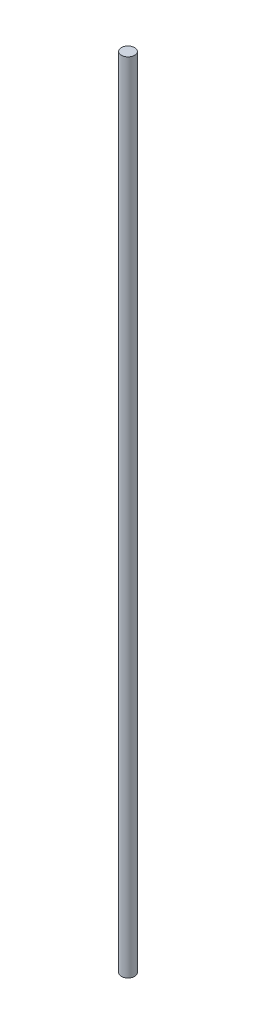
ISO-10303-21;
HEADER;
FILE_DESCRIPTION(('STEP AP214'),'2;1');
FILE_NAME('part.step','',(''),(''),'','','');
FILE_SCHEMA(('AUTOMOTIVE_DESIGN { 1 0 10303 214 1 1 1 1 }'));
ENDSEC;
DATA;
#1=APPLICATION_CONTEXT('core data for automotive mechanical design processes');
#2=APPLICATION_PROTOCOL_DEFINITION('international standard','automotive_design',2000,#1);
#3=PRODUCT_CONTEXT('',#1,'mechanical');
#4=PRODUCT('Part','Part','',(#3));
#5=PRODUCT_RELATED_PRODUCT_CATEGORY('part','',(#4));
#6=PRODUCT_DEFINITION_FORMATION('','',#4);
#7=PRODUCT_DEFINITION_CONTEXT('part definition',#1,'design');
#8=PRODUCT_DEFINITION('design','',#6,#7);
#9=PRODUCT_DEFINITION_SHAPE('','',#8);
#10=(LENGTH_UNIT() NAMED_UNIT(*) SI_UNIT(.MILLI.,.METRE.));
#11=(NAMED_UNIT(*) PLANE_ANGLE_UNIT() SI_UNIT($,.RADIAN.));
#12=(NAMED_UNIT(*) SI_UNIT($,.STERADIAN.) SOLID_ANGLE_UNIT());
#13=UNCERTAINTY_MEASURE_WITH_UNIT(LENGTH_MEASURE(1.E-05),#10,'distance_accuracy_value','');
#14=(GEOMETRIC_REPRESENTATION_CONTEXT(3) GLOBAL_UNCERTAINTY_ASSIGNED_CONTEXT((#13)) GLOBAL_UNIT_ASSIGNED_CONTEXT((#10,
#11,#12)) REPRESENTATION_CONTEXT('',''));
#15=CARTESIAN_POINT('',(0.,0.,0.));
#16=DIRECTION('',(0.,0.,1.));
#17=DIRECTION('',(1.,0.,0.));
#18=AXIS2_PLACEMENT_3D('',#15,#16,#17);
#19=CARTESIAN_POINT('',(0.,1200.,0.));
#20=DIRECTION('',(0.,-1.,0.));
#21=DIRECTION('',(0.,0.,-1.));
#22=AXIS2_PLACEMENT_3D('',#19,#20,#21);
#23=CYLINDRICAL_SURFACE('',#22,10.);
#24=CARTESIAN_POINT('',(0.,1200.,0.));
#25=DIRECTION('',(0.,1.,0.));
#26=DIRECTION('',(0.,0.,1.));
#27=AXIS2_PLACEMENT_3D('',#24,#25,#26);
#28=CIRCLE('',#27,10.);
#29=CARTESIAN_POINT('',(0.,1200.,10.));
#30=VERTEX_POINT('',#29);
#31=EDGE_CURVE('E10',#30,#30,#28,.T.);
#32=ORIENTED_EDGE('',*,*,#31,.F.);
#33=EDGE_LOOP('',(#32));
#34=FACE_BOUND('',#33,.T.);
#35=CARTESIAN_POINT('',(0.,0.,0.));
#36=DIRECTION('',(0.,1.,0.));
#37=DIRECTION('',(0.,0.,1.));
#38=AXIS2_PLACEMENT_3D('',#35,#36,#37);
#39=CIRCLE('',#38,10.);
#40=CARTESIAN_POINT('',(0.,0.,10.));
#41=VERTEX_POINT('',#40);
#42=EDGE_CURVE('E38',#41,#41,#39,.T.);
#43=ORIENTED_EDGE('',*,*,#42,.T.);
#44=EDGE_LOOP('',(#43));
#45=FACE_BOUND('',#44,.T.);
#46=ADVANCED_FACE('F35',(#34,#45),#23,.T.);
#47=CARTESIAN_POINT('',(0.,1200.,0.));
#48=DIRECTION('',(0.,1.,0.));
#49=DIRECTION('',(0.,0.,1.));
#50=AXIS2_PLACEMENT_3D('',#47,#48,#49);
#51=PLANE('',#50);
#52=ORIENTED_EDGE('',*,*,#31,.T.);
#53=EDGE_LOOP('',(#52));
#54=FACE_BOUND('',#53,.T.);
#55=ADVANCED_FACE('F50',(#54),#51,.T.);
#56=CARTESIAN_POINT('',(0.,0.,0.));
#57=DIRECTION('',(0.,1.,0.));
#58=DIRECTION('',(0.,0.,1.));
#59=AXIS2_PLACEMENT_3D('',#56,#57,#58);
#60=PLANE('',#59);
#61=ORIENTED_EDGE('',*,*,#42,.F.);
#62=EDGE_LOOP('',(#61));
#63=FACE_BOUND('',#62,.T.);
#64=ADVANCED_FACE('F48',(#63),#60,.F.);
#65=CLOSED_SHELL('',(#46,#55,#64));
#66=MANIFOLD_SOLID_BREP('B2',#65);
#67=ADVANCED_BREP_SHAPE_REPRESENTATION('',(#18,#66),#14);
#68=SHAPE_DEFINITION_REPRESENTATION(#9,#67);
ENDSEC;
END-ISO-10303-21;
